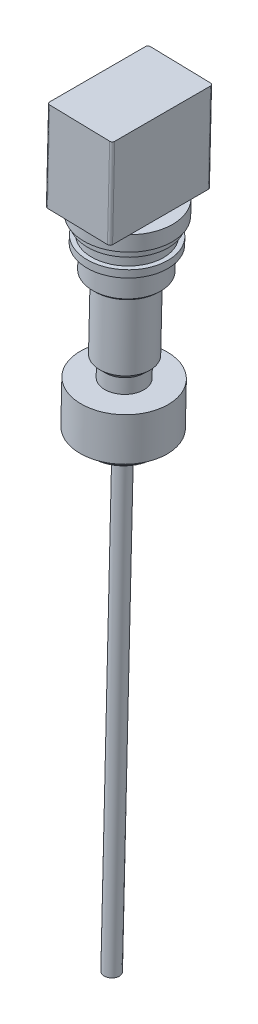
ISO-10303-21;
HEADER;
FILE_DESCRIPTION(('STEP AP214'),'2;1');
FILE_NAME('part.step','',(''),(''),'','','');
FILE_SCHEMA(('AUTOMOTIVE_DESIGN { 1 0 10303 214 1 1 1 1 }'));
ENDSEC;
DATA;
#1=APPLICATION_CONTEXT('core data for automotive mechanical design processes');
#2=APPLICATION_PROTOCOL_DEFINITION('international standard','automotive_design',2000,#1);
#3=PRODUCT_CONTEXT('',#1,'mechanical');
#4=PRODUCT('Part','Part','',(#3));
#5=PRODUCT_RELATED_PRODUCT_CATEGORY('part','',(#4));
#6=PRODUCT_DEFINITION_FORMATION('','',#4);
#7=PRODUCT_DEFINITION_CONTEXT('part definition',#1,'design');
#8=PRODUCT_DEFINITION('design','',#6,#7);
#9=PRODUCT_DEFINITION_SHAPE('','',#8);
#10=(LENGTH_UNIT() NAMED_UNIT(*) SI_UNIT(.MILLI.,.METRE.));
#11=(NAMED_UNIT(*) PLANE_ANGLE_UNIT() SI_UNIT($,.RADIAN.));
#12=(NAMED_UNIT(*) SI_UNIT($,.STERADIAN.) SOLID_ANGLE_UNIT());
#13=UNCERTAINTY_MEASURE_WITH_UNIT(LENGTH_MEASURE(1.E-05),#10,'distance_accuracy_value','');
#14=(GEOMETRIC_REPRESENTATION_CONTEXT(3) GLOBAL_UNCERTAINTY_ASSIGNED_CONTEXT((#13)) GLOBAL_UNIT_ASSIGNED_CONTEXT((#10,
#11,#12)) REPRESENTATION_CONTEXT('',''));
#15=CARTESIAN_POINT('',(0.,0.,0.));
#16=DIRECTION('',(0.,0.,1.));
#17=DIRECTION('',(1.,0.,0.));
#18=AXIS2_PLACEMENT_3D('',#15,#16,#17);
#19=CARTESIAN_POINT('',(12.9138102123787,538.947908708833,0.));
#20=DIRECTION('',(0.0239542717466765,0.999713055263903,0.));
#21=DIRECTION('',(-0.999713055263903,0.0239542717466765,0.));
#22=AXIS2_PLACEMENT_3D('',#19,#20,#21);
#23=PLANE('',#22);
#24=DIRECTION('',(0.,0.,1.));
#25=VECTOR('',#24,1.);
#26=CARTESIAN_POINT('',(327.625903297043,531.407045898229,39.5));
#27=LINE('',#26,#25);
#28=CARTESIAN_POINT('',(327.625903297043,531.407045898229,-23.9739441894736));
#29=VERTEX_POINT('',#28);
#30=CARTESIAN_POINT('',(327.625903297043,531.407045898229,23.9739441894736));
#31=VERTEX_POINT('',#30);
#32=EDGE_CURVE('E157',#29,#31,#27,.T.);
#33=ORIENTED_EDGE('',*,*,#32,.F.);
#34=CARTESIAN_POINT('',(353.118586206273,530.796211968689,0.));
#35=DIRECTION('',(-0.0239542717466765,-0.999713055263903,0.));
#36=DIRECTION('',(0.999713055263903,-0.0239542717466765,0.));
#37=AXIS2_PLACEMENT_3D('',#34,#35,#36);
#38=CIRCLE('',#37,35.);
#39=EDGE_CURVE('E133',#31,#29,#38,.T.);
#40=ORIENTED_EDGE('',*,*,#39,.F.);
#41=EDGE_LOOP('',(#33,#40));
#42=FACE_BOUND('',#41,.T.);
#43=ADVANCED_FACE('F49',(#42),#23,.T.);
#44=CARTESIAN_POINT('',(340.383332009777,-0.699799138684732,0.));
#45=DIRECTION('',(-0.0239542717466765,-0.999713055263903,0.));
#46=DIRECTION('',(0.999713055263903,-0.0239542717466765,0.));
#47=AXIS2_PLACEMENT_3D('',#44,#45,#46);
#48=CYLINDRICAL_SURFACE('',#47,35.);
#49=CARTESIAN_POINT('',(378.611269115502,530.185378039148,23.9739441894738));
#50=VERTEX_POINT('',#49);
#51=EDGE_CURVE('E144',#50,#31,#38,.T.);
#52=ORIENTED_EDGE('',*,*,#51,.T.);
#53=ORIENTED_EDGE('',*,*,#39,.T.);
#54=CARTESIAN_POINT('',(378.611269115502,530.185378039148,-23.9739441894738));
#55=VERTEX_POINT('',#54);
#56=EDGE_CURVE('E126',#29,#55,#38,.T.);
#57=ORIENTED_EDGE('',*,*,#56,.T.);
#58=EDGE_CURVE('E131',#55,#50,#38,.T.);
#59=ORIENTED_EDGE('',*,*,#58,.T.);
#60=EDGE_LOOP('',(#52,#53,#57,#59));
#61=FACE_BOUND('',#60,.T.);
#62=CARTESIAN_POINT('',(352.831134945312,518.799655305522,0.));
#63=DIRECTION('',(-0.0239542717466765,-0.999713055263903,0.));
#64=DIRECTION('',(0.999713055263903,-0.0239542717466765,0.));
#65=AXIS2_PLACEMENT_3D('',#62,#63,#64);
#66=CIRCLE('',#65,35.);
#67=CARTESIAN_POINT('',(387.821091879549,517.961255794388,0.));
#68=VERTEX_POINT('',#67);
#69=EDGE_CURVE('E179',#68,#68,#66,.T.);
#70=ORIENTED_EDGE('',*,*,#69,.F.);
#71=EDGE_LOOP('',(#70));
#72=FACE_BOUND('',#71,.T.);
#73=ADVANCED_FACE('F129',(#61,#72),#48,.T.);
#74=DIRECTION('',(0.,0.,-1.));
#75=VECTOR('',#74,1.);
#76=CARTESIAN_POINT('',(378.611269115502,530.185378039148,39.5));
#77=LINE('',#76,#75);
#78=EDGE_CURVE('E142',#50,#55,#77,.T.);
#79=ORIENTED_EDGE('',*,*,#78,.F.);
#80=ORIENTED_EDGE('',*,*,#58,.F.);
#81=EDGE_LOOP('',(#79,#80));
#82=FACE_BOUND('',#81,.T.);
#83=ADVANCED_FACE('F140',(#82),#23,.T.);
#84=CARTESIAN_POINT('',(0.178556015882637,7.45189760146009,0.));
#85=DIRECTION('',(-0.0239542717466765,-0.999713055263903,0.));
#86=DIRECTION('',(0.999713055263903,-0.0239542717466765,0.));
#87=AXIS2_PLACEMENT_3D('',#84,#85,#86);
#88=PLANE('',#87);
#89=CARTESIAN_POINT('',(340.383332009777,-0.699799138684731,0.));
#90=DIRECTION('',(-0.0239542717466765,-0.999713055263903,0.));
#91=DIRECTION('',(0.999713055263903,-0.0239542717466765,0.));
#92=AXIS2_PLACEMENT_3D('',#89,#90,#91);
#93=CIRCLE('',#92,5.99999999999998);
#94=CARTESIAN_POINT('',(346.381610341361,-0.84352476916479,0.));
#95=VERTEX_POINT('',#94);
#96=EDGE_CURVE('E143',#95,#95,#93,.T.);
#97=ORIENTED_EDGE('',*,*,#96,.T.);
#98=EDGE_LOOP('',(#97));
#99=FACE_BOUND('',#98,.T.);
#100=ADVANCED_FACE('F298',(#99),#88,.T.);
#101=CARTESIAN_POINT('',(340.383332009777,-0.699799138684732,0.));
#102=DIRECTION('',(-0.0239542717466765,-0.999713055263903,0.));
#103=DIRECTION('',(0.999713055263903,-0.0239542717466765,0.));
#104=AXIS2_PLACEMENT_3D('',#101,#102,#103);
#105=CYLINDRICAL_SURFACE('',#104,5.99999999999993);
#106=CARTESIAN_POINT('',(349.118222824578,363.844131739617,0.));
#107=DIRECTION('',(-0.0239542717466765,-0.999713055263903,0.));
#108=DIRECTION('',(0.999713055263903,-0.0239542717466765,0.));
#109=AXIS2_PLACEMENT_3D('',#106,#107,#108);
#110=CIRCLE('',#109,5.99999999999989);
#111=CARTESIAN_POINT('',(355.116501156161,363.700406109137,0.));
#112=VERTEX_POINT('',#111);
#113=EDGE_CURVE('E219',#112,#112,#110,.T.);
#114=ORIENTED_EDGE('',*,*,#113,.T.);
#115=EDGE_LOOP('',(#114));
#116=FACE_BOUND('',#115,.T.);
#117=ORIENTED_EDGE('',*,*,#96,.F.);
#118=EDGE_LOOP('',(#117));
#119=FACE_BOUND('',#118,.T.);
#120=ADVANCED_FACE('F302',(#116,#119),#105,.T.);
#121=CARTESIAN_POINT('',(8.91344683068299,371.995828479762,0.));
#122=DIRECTION('',(-0.0239542717466765,-0.999713055263903,0.));
#123=DIRECTION('',(0.999713055263903,-0.0239542717466765,0.));
#124=AXIS2_PLACEMENT_3D('',#121,#122,#123);
#125=PLANE('',#124);
#126=CARTESIAN_POINT('',(349.118222824578,363.844131739617,0.));
#127=DIRECTION('',(-0.0239542717466765,-0.999713055263903,0.));
#128=DIRECTION('',(0.999713055263903,-0.0239542717466765,0.));
#129=AXIS2_PLACEMENT_3D('',#126,#127,#128);
#130=CIRCLE('',#129,23.7499999999996);
#131=CARTESIAN_POINT('',(372.861407887095,363.275217785633,0.));
#132=VERTEX_POINT('',#131);
#133=EDGE_CURVE('E165',#132,#132,#130,.T.);
#134=ORIENTED_EDGE('',*,*,#133,.T.);
#135=EDGE_LOOP('',(#134));
#136=FACE_BOUND('',#135,.T.);
#137=ORIENTED_EDGE('',*,*,#113,.F.);
#138=EDGE_LOOP('',(#137));
#139=FACE_BOUND('',#138,.T.);
#140=ADVANCED_FACE('F307',(#136,#139),#125,.T.);
#141=CARTESIAN_POINT('',(340.383332009777,-0.699799138684732,0.));
#142=DIRECTION('',(-0.0239542717466765,-0.999713055263903,0.));
#143=DIRECTION('',(0.999713055263903,-0.0239542717466765,0.));
#144=AXIS2_PLACEMENT_3D('',#141,#142,#143);
#145=CYLINDRICAL_SURFACE('',#144,25.7499999999998);
#146=CARTESIAN_POINT('',(349.166131368071,365.843557850145,0.));
#147=DIRECTION('',(-0.0239542717466731,-0.999713055263903,0.));
#148=DIRECTION('',(0.999713055263903,-0.0239542717466731,0.));
#149=AXIS2_PLACEMENT_3D('',#146,#147,#148);
#150=CIRCLE('',#149,25.7499999999998);
#151=CARTESIAN_POINT('',(374.908742541116,365.226735352668,0.));
#152=VERTEX_POINT('',#151);
#153=EDGE_CURVE('E158',#152,#152,#150,.F.);
#154=ORIENTED_EDGE('',*,*,#153,.T.);
#155=EDGE_LOOP('',(#154));
#156=FACE_BOUND('',#155,.T.);
#157=CARTESIAN_POINT('',(349.333811270298,372.841549236992,0.));
#158=DIRECTION('',(-0.0239542717466765,-0.999713055263903,0.));
#159=DIRECTION('',(0.999713055263903,-0.0239542717466765,0.));
#160=AXIS2_PLACEMENT_3D('',#157,#158,#159);
#161=CIRCLE('',#160,25.7499999999998);
#162=CARTESIAN_POINT('',(375.076422443343,372.224726739515,0.));
#163=VERTEX_POINT('',#162);
#164=EDGE_CURVE('E216',#163,#163,#161,.T.);
#165=ORIENTED_EDGE('',*,*,#164,.T.);
#166=EDGE_LOOP('',(#165));
#167=FACE_BOUND('',#166,.T.);
#168=ADVANCED_FACE('F313',(#156,#167),#145,.T.);
#169=CARTESIAN_POINT('',(9.1290352764018,380.993245977137,0.));
#170=DIRECTION('',(-0.0239542717466765,-0.999713055263903,0.));
#171=DIRECTION('',(0.999713055263903,-0.0239542717466765,0.));
#172=AXIS2_PLACEMENT_3D('',#169,#170,#171);
#173=PLANE('',#172);
#174=CARTESIAN_POINT('',(349.333811270298,372.841549236992,0.));
#175=DIRECTION('',(-0.0239542717466765,-0.999713055263903,0.));
#176=DIRECTION('',(0.999713055263903,-0.0239542717466765,0.));
#177=AXIS2_PLACEMENT_3D('',#174,#175,#176);
#178=CIRCLE('',#177,34.5000000000004);
#179=CARTESIAN_POINT('',(383.823911676903,372.015126861732,0.));
#180=VERTEX_POINT('',#179);
#181=EDGE_CURVE('E213',#180,#180,#178,.T.);
#182=ORIENTED_EDGE('',*,*,#181,.T.);
#183=EDGE_LOOP('',(#182));
#184=FACE_BOUND('',#183,.T.);
#185=ORIENTED_EDGE('',*,*,#164,.F.);
#186=EDGE_LOOP('',(#185));
#187=FACE_BOUND('',#186,.T.);
#188=ADVANCED_FACE('F317',(#184,#187),#173,.T.);
#189=CARTESIAN_POINT('',(340.383332009777,-0.699799138684732,0.));
#190=DIRECTION('',(-0.0239542717466765,-0.999713055263903,0.));
#191=DIRECTION('',(0.999713055263903,-0.0239542717466765,0.));
#192=AXIS2_PLACEMENT_3D('',#189,#190,#191);
#193=CYLINDRICAL_SURFACE('',#192,34.5000000000004);
#194=CARTESIAN_POINT('',(350.148256509685,406.831793115965,0.));
#195=DIRECTION('',(-0.0239542717466765,-0.999713055263903,0.));
#196=DIRECTION('',(0.999713055263903,-0.0239542717466765,0.));
#197=AXIS2_PLACEMENT_3D('',#194,#195,#196);
#198=CIRCLE('',#197,34.5000000000004);
#199=CARTESIAN_POINT('',(384.63835691629,406.005370740704,0.));
#200=VERTEX_POINT('',#199);
#201=EDGE_CURVE('E210',#200,#200,#198,.T.);
#202=ORIENTED_EDGE('',*,*,#201,.T.);
#203=EDGE_LOOP('',(#202));
#204=FACE_BOUND('',#203,.T.);
#205=ORIENTED_EDGE('',*,*,#181,.F.);
#206=EDGE_LOOP('',(#205));
#207=FACE_BOUND('',#206,.T.);
#208=ADVANCED_FACE('F321',(#204,#207),#193,.T.);
#209=CARTESIAN_POINT('',(9.94348051578969,414.983489856109,0.));
#210=DIRECTION('',(0.0239542717466765,0.999713055263903,0.));
#211=DIRECTION('',(-0.999713055263903,0.0239542717466765,0.));
#212=AXIS2_PLACEMENT_3D('',#209,#210,#211);
#213=PLANE('',#212);
#214=CARTESIAN_POINT('',(350.148256509685,406.831793115965,0.));
#215=DIRECTION('',(-0.0239542717466765,-0.999713055263903,0.));
#216=DIRECTION('',(0.999713055263903,-0.0239542717466765,0.));
#217=AXIS2_PLACEMENT_3D('',#214,#215,#216);
#218=CIRCLE('',#217,15.5000000000001);
#219=CARTESIAN_POINT('',(365.643808866275,406.460501903891,0.));
#220=VERTEX_POINT('',#219);
#221=EDGE_CURVE('E207',#220,#220,#218,.T.);
#222=ORIENTED_EDGE('',*,*,#221,.T.);
#223=EDGE_LOOP('',(#222));
#224=FACE_BOUND('',#223,.T.);
#225=ORIENTED_EDGE('',*,*,#201,.F.);
#226=EDGE_LOOP('',(#225));
#227=FACE_BOUND('',#226,.T.);
#228=ADVANCED_FACE('F325',(#224,#227),#213,.T.);
#229=CARTESIAN_POINT('',(340.383332009777,-0.699799138684732,0.));
#230=DIRECTION('',(-0.0239542717466765,-0.999713055263903,0.));
#231=DIRECTION('',(0.999713055263903,-0.0239542717466765,0.));
#232=AXIS2_PLACEMENT_3D('',#229,#230,#231);
#233=CYLINDRICAL_SURFACE('',#232,15.5000000000001);
#234=CARTESIAN_POINT('',(350.423730634771,418.328493251502,0.));
#235=DIRECTION('',(0.0239542717466733,0.999713055263903,0.));
#236=DIRECTION('',(-0.999713055263903,0.0239542717466733,0.));
#237=AXIS2_PLACEMENT_3D('',#234,#235,#236);
#238=CIRCLE('',#237,15.5000000000001);
#239=CARTESIAN_POINT('',(334.928178278181,418.699784463575,0.));
#240=VERTEX_POINT('',#239);
#241=EDGE_CURVE('E227',#240,#240,#238,.F.);
#242=ORIENTED_EDGE('',*,*,#241,.T.);
#243=EDGE_LOOP('',(#242));
#244=FACE_BOUND('',#243,.T.);
#245=ORIENTED_EDGE('',*,*,#221,.F.);
#246=EDGE_LOOP('',(#245));
#247=FACE_BOUND('',#246,.T.);
#248=ADVANCED_FACE('F329',(#244,#247),#233,.T.);
#249=CARTESIAN_POINT('',(340.383332009777,-0.699799138684732,0.));
#250=DIRECTION('',(-0.0239542717466765,-0.999713055263903,0.));
#251=DIRECTION('',(0.999713055263903,-0.0239542717466765,0.));
#252=AXIS2_PLACEMENT_3D('',#249,#250,#251);
#253=CYLINDRICAL_SURFACE('',#252,19.9999999999979);
#254=CARTESIAN_POINT('',(350.531524857631,422.827202000187,0.));
#255=DIRECTION('',(-0.0239542717466733,-0.999713055263903,0.));
#256=DIRECTION('',(0.999713055263903,-0.0239542717466733,0.));
#257=AXIS2_PLACEMENT_3D('',#254,#255,#256);
#258=CIRCLE('',#257,19.9999999999979);
#259=CARTESIAN_POINT('',(370.525785962907,422.348116565254,0.));
#260=VERTEX_POINT('',#259);
#261=EDGE_CURVE('E224',#260,#260,#258,.F.);
#262=ORIENTED_EDGE('',*,*,#261,.T.);
#263=EDGE_LOOP('',(#262));
#264=FACE_BOUND('',#263,.T.);
#265=CARTESIAN_POINT('',(351.872964075445,478.811133094966,0.));
#266=DIRECTION('',(-0.0239542717466765,-0.999713055263903,0.));
#267=DIRECTION('',(0.999713055263903,-0.0239542717466765,0.));
#268=AXIS2_PLACEMENT_3D('',#265,#266,#267);
#269=CIRCLE('',#268,19.9999999999979);
#270=CARTESIAN_POINT('',(371.867225180721,478.332047660032,0.));
#271=VERTEX_POINT('',#270);
#272=EDGE_CURVE('E204',#271,#271,#269,.T.);
#273=ORIENTED_EDGE('',*,*,#272,.T.);
#274=EDGE_LOOP('',(#273));
#275=FACE_BOUND('',#274,.T.);
#276=ADVANCED_FACE('F333',(#264,#275),#253,.T.);
#277=CARTESIAN_POINT('',(11.6681880815484,486.962829835111,0.));
#278=DIRECTION('',(-0.0239542717466765,-0.999713055263903,0.));
#279=DIRECTION('',(0.999713055263903,-0.0239542717466765,0.));
#280=AXIS2_PLACEMENT_3D('',#277,#278,#279);
#281=PLANE('',#280);
#282=CARTESIAN_POINT('',(351.872964075445,478.811133094966,0.));
#283=DIRECTION('',(-0.0239542717466765,-0.999713055263903,0.));
#284=DIRECTION('',(0.999713055263903,-0.0239542717466765,0.));
#285=AXIS2_PLACEMENT_3D('',#282,#283,#284);
#286=CIRCLE('',#285,25.);
#287=CARTESIAN_POINT('',(376.865790457043,478.212276301299,0.));
#288=VERTEX_POINT('',#287);
#289=EDGE_CURVE('E230',#288,#288,#286,.T.);
#290=ORIENTED_EDGE('',*,*,#289,.T.);
#291=EDGE_LOOP('',(#290));
#292=FACE_BOUND('',#291,.T.);
#293=ORIENTED_EDGE('',*,*,#272,.F.);
#294=EDGE_LOOP('',(#293));
#295=FACE_BOUND('',#294,.T.);
#296=ADVANCED_FACE('F337',(#292,#295),#281,.T.);
#297=CARTESIAN_POINT('',(340.383332009777,-0.699799138684732,0.));
#298=DIRECTION('',(-0.0239542717466765,-0.999713055263903,0.));
#299=DIRECTION('',(0.999713055263903,-0.0239542717466765,0.));
#300=AXIS2_PLACEMENT_3D('',#297,#298,#299);
#301=CYLINDRICAL_SURFACE('',#300,27.0000000000007);
#302=CARTESIAN_POINT('',(351.920872618939,480.810559205494,0.));
#303=DIRECTION('',(-0.0239542717466691,-0.999713055263903,0.));
#304=DIRECTION('',(0.999713055263903,-0.0239542717466691,0.));
#305=AXIS2_PLACEMENT_3D('',#302,#303,#304);
#306=CIRCLE('',#305,27.0000000000007);
#307=CARTESIAN_POINT('',(378.913125111065,480.163793868334,0.));
#308=VERTEX_POINT('',#307);
#309=EDGE_CURVE('E233',#308,#308,#306,.F.);
#310=ORIENTED_EDGE('',*,*,#309,.T.);
#311=EDGE_LOOP('',(#310));
#312=FACE_BOUND('',#311,.T.);
#313=CARTESIAN_POINT('',(352.352049510379,498.805394200244,0.));
#314=DIRECTION('',(-0.0239542717466765,-0.999713055263903,0.));
#315=DIRECTION('',(0.999713055263903,-0.0239542717466765,0.));
#316=AXIS2_PLACEMENT_3D('',#313,#314,#315);
#317=CIRCLE('',#316,27.0000000000007);
#318=CARTESIAN_POINT('',(379.344302002505,498.158628863083,0.));
#319=VERTEX_POINT('',#318);
#320=EDGE_CURVE('E201',#319,#319,#317,.T.);
#321=ORIENTED_EDGE('',*,*,#320,.T.);
#322=EDGE_LOOP('',(#321));
#323=FACE_BOUND('',#322,.T.);
#324=ADVANCED_FACE('F341',(#312,#323),#301,.T.);
#325=CARTESIAN_POINT('',(12.1472735164842,506.957090940389,0.));
#326=DIRECTION('',(-0.0239542717466765,-0.999713055263903,0.));
#327=DIRECTION('',(0.999713055263903,-0.0239542717466765,0.));
#328=AXIS2_PLACEMENT_3D('',#325,#326,#327);
#329=PLANE('',#328);
#330=CARTESIAN_POINT('',(352.352049510379,498.805394200244,0.));
#331=DIRECTION('',(-0.0239542717466765,-0.999713055263903,0.));
#332=DIRECTION('',(0.999713055263903,-0.0239542717466765,0.));
#333=AXIS2_PLACEMENT_3D('',#330,#331,#332);
#334=CIRCLE('',#333,32.);
#335=CARTESIAN_POINT('',(384.342867278824,498.03885750435,0.));
#336=VERTEX_POINT('',#335);
#337=EDGE_CURVE('E198',#336,#336,#334,.T.);
#338=ORIENTED_EDGE('',*,*,#337,.T.);
#339=EDGE_LOOP('',(#338));
#340=FACE_BOUND('',#339,.T.);
#341=ORIENTED_EDGE('',*,*,#320,.F.);
#342=EDGE_LOOP('',(#341));
#343=FACE_BOUND('',#342,.T.);
#344=ADVANCED_FACE('F345',(#340,#343),#329,.T.);
#345=CARTESIAN_POINT('',(340.383332009777,-0.699799138684732,0.));
#346=DIRECTION('',(-0.0239542717466765,-0.999713055263903,0.));
#347=DIRECTION('',(0.999713055263903,-0.0239542717466765,0.));
#348=AXIS2_PLACEMENT_3D('',#345,#346,#347);
#349=CYLINDRICAL_SURFACE('',#348,32.);
#350=CARTESIAN_POINT('',(352.488588859335,504.503758615248,0.));
#351=DIRECTION('',(-0.0239542717466765,-0.999713055263903,0.));
#352=DIRECTION('',(0.999713055263903,-0.0239542717466765,0.));
#353=AXIS2_PLACEMENT_3D('',#350,#351,#352);
#354=CIRCLE('',#353,32.);
#355=CARTESIAN_POINT('',(384.47940662778,503.737221919354,0.));
#356=VERTEX_POINT('',#355);
#357=EDGE_CURVE('E195',#356,#356,#354,.T.);
#358=ORIENTED_EDGE('',*,*,#357,.T.);
#359=EDGE_LOOP('',(#358));
#360=FACE_BOUND('',#359,.T.);
#361=ORIENTED_EDGE('',*,*,#337,.F.);
#362=EDGE_LOOP('',(#361));
#363=FACE_BOUND('',#362,.T.);
#364=ADVANCED_FACE('F349',(#360,#363),#349,.T.);
#365=CARTESIAN_POINT('',(12.2838128654429,512.655455355393,0.));
#366=DIRECTION('',(0.0239542717466765,0.999713055263903,0.));
#367=DIRECTION('',(-0.999713055263903,0.0239542717466765,0.));
#368=AXIS2_PLACEMENT_3D('',#365,#366,#367);
#369=PLANE('',#368);
#370=CARTESIAN_POINT('',(352.488588859335,504.503758615248,0.));
#371=DIRECTION('',(-0.0239542717466765,-0.999713055263903,0.));
#372=DIRECTION('',(0.999713055263903,-0.0239542717466765,0.));
#373=AXIS2_PLACEMENT_3D('',#370,#371,#372);
#374=CIRCLE('',#373,28.5000000000001);
#375=CARTESIAN_POINT('',(380.980410934356,503.821061870468,0.));
#376=VERTEX_POINT('',#375);
#377=EDGE_CURVE('E192',#376,#376,#374,.T.);
#378=ORIENTED_EDGE('',*,*,#377,.T.);
#379=EDGE_LOOP('',(#378));
#380=FACE_BOUND('',#379,.T.);
#381=ORIENTED_EDGE('',*,*,#357,.F.);
#382=EDGE_LOOP('',(#381));
#383=FACE_BOUND('',#382,.T.);
#384=ADVANCED_FACE('F353',(#380,#383),#369,.T.);
#385=CARTESIAN_POINT('',(340.383332009777,-0.699799138684732,0.));
#386=DIRECTION('',(-0.0239542717466765,-0.999713055263903,0.));
#387=DIRECTION('',(0.999713055263903,-0.0239542717466765,0.));
#388=AXIS2_PLACEMENT_3D('',#385,#386,#387);
#389=CYLINDRICAL_SURFACE('',#388,28.5);
#390=CARTESIAN_POINT('',(352.694595596356,513.101290890518,0.));
#391=DIRECTION('',(-0.0239542717466765,-0.999713055263903,0.));
#392=DIRECTION('',(0.999713055263903,-0.0239542717466765,0.));
#393=AXIS2_PLACEMENT_3D('',#390,#391,#392);
#394=CIRCLE('',#393,28.5);
#395=CARTESIAN_POINT('',(381.186417671378,512.418594145737,0.));
#396=VERTEX_POINT('',#395);
#397=EDGE_CURVE('E189',#396,#396,#394,.T.);
#398=ORIENTED_EDGE('',*,*,#397,.T.);
#399=EDGE_LOOP('',(#398));
#400=FACE_BOUND('',#399,.T.);
#401=ORIENTED_EDGE('',*,*,#377,.F.);
#402=EDGE_LOOP('',(#401));
#403=FACE_BOUND('',#402,.T.);
#404=ADVANCED_FACE('F357',(#400,#403),#389,.T.);
#405=CARTESIAN_POINT('',(12.4898196024273,521.252987630663,0.));
#406=DIRECTION('',(-0.0239542717466765,-0.999713055263903,0.));
#407=DIRECTION('',(0.999713055263903,-0.0239542717466765,0.));
#408=AXIS2_PLACEMENT_3D('',#405,#406,#407);
#409=PLANE('',#408);
#410=CARTESIAN_POINT('',(352.694595596356,513.101290890518,0.));
#411=DIRECTION('',(-0.0239542717466765,-0.999713055263903,0.));
#412=DIRECTION('',(0.999713055263903,-0.0239542717466765,0.));
#413=AXIS2_PLACEMENT_3D('',#410,#411,#412);
#414=CIRCLE('',#413,32.0000000000011);
#415=CARTESIAN_POINT('',(384.685413364802,512.334754194624,0.));
#416=VERTEX_POINT('',#415);
#417=EDGE_CURVE('E186',#416,#416,#414,.T.);
#418=ORIENTED_EDGE('',*,*,#417,.T.);
#419=EDGE_LOOP('',(#418));
#420=FACE_BOUND('',#419,.T.);
#421=ORIENTED_EDGE('',*,*,#397,.F.);
#422=EDGE_LOOP('',(#421));
#423=FACE_BOUND('',#422,.T.);
#424=ADVANCED_FACE('F361',(#420,#423),#409,.T.);
#425=CARTESIAN_POINT('',(340.383332009777,-0.699799138684732,0.));
#426=DIRECTION('',(-0.0239542717466765,-0.999713055263903,0.));
#427=DIRECTION('',(0.999713055263903,-0.0239542717466765,0.));
#428=AXIS2_PLACEMENT_3D('',#425,#426,#427);
#429=CYLINDRICAL_SURFACE('',#428,32.0000000000003);
#430=CARTESIAN_POINT('',(352.831134945312,518.799655305522,0.));
#431=DIRECTION('',(-0.0239542717466765,-0.999713055263903,0.));
#432=DIRECTION('',(0.999713055263903,-0.0239542717466765,0.));
#433=AXIS2_PLACEMENT_3D('',#430,#431,#432);
#434=CIRCLE('',#433,31.9999999999995);
#435=CARTESIAN_POINT('',(384.821952713757,518.033118609628,0.));
#436=VERTEX_POINT('',#435);
#437=EDGE_CURVE('E182',#436,#436,#434,.T.);
#438=ORIENTED_EDGE('',*,*,#437,.T.);
#439=EDGE_LOOP('',(#438));
#440=FACE_BOUND('',#439,.T.);
#441=ORIENTED_EDGE('',*,*,#417,.F.);
#442=EDGE_LOOP('',(#441));
#443=FACE_BOUND('',#442,.T.);
#444=ADVANCED_FACE('F365',(#440,#443),#429,.T.);
#445=CARTESIAN_POINT('',(12.6263589514237,526.951352045666,0.));
#446=DIRECTION('',(-0.0239542717466765,-0.999713055263903,0.));
#447=DIRECTION('',(0.999713055263903,-0.0239542717466765,0.));
#448=AXIS2_PLACEMENT_3D('',#445,#446,#447);
#449=PLANE('',#448);
#450=ORIENTED_EDGE('',*,*,#69,.T.);
#451=EDGE_LOOP('',(#450));
#452=FACE_BOUND('',#451,.T.);
#453=ORIENTED_EDGE('',*,*,#437,.F.);
#454=EDGE_LOOP('',(#453));
#455=FACE_BOUND('',#454,.T.);
#456=ADVANCED_FACE('F369',(#452,#455),#449,.T.);
#457=CARTESIAN_POINT('',(350.411753498898,417.828636723868,0.));
#458=DIRECTION('',(0.0239542717466733,0.999713055263903,0.));
#459=DIRECTION('',(-0.999713055263903,0.0239542717466733,0.));
#460=AXIS2_PLACEMENT_3D('',#457,#458,#459);
#461=CONICAL_SURFACE('',#460,14.9999999999978,0.785398163397462);
#462=ORIENTED_EDGE('',*,*,#261,.F.);
#463=EDGE_LOOP('',(#462));
#464=FACE_BOUND('',#463,.T.);
#465=ORIENTED_EDGE('',*,*,#241,.F.);
#466=EDGE_LOOP('',(#465));
#467=FACE_BOUND('',#466,.T.);
#468=ADVANCED_FACE('F373',(#464,#467),#461,.T.);
#469=CARTESIAN_POINT('',(351.872964075445,478.811133094966,0.));
#470=DIRECTION('',(0.0239542717466691,0.999713055263903,0.));
#471=DIRECTION('',(-0.999713055263903,0.0239542717466691,0.));
#472=AXIS2_PLACEMENT_3D('',#469,#470,#471);
#473=CONICAL_SURFACE('',#472,25.0000000000002,0.785398163397476);
#474=ORIENTED_EDGE('',*,*,#309,.F.);
#475=EDGE_LOOP('',(#474));
#476=FACE_BOUND('',#475,.T.);
#477=ORIENTED_EDGE('',*,*,#289,.F.);
#478=EDGE_LOOP('',(#477));
#479=FACE_BOUND('',#478,.T.);
#480=ADVANCED_FACE('F473',(#476,#479),#473,.T.);
#481=CARTESIAN_POINT('',(349.118222824578,363.844131739617,0.));
#482=DIRECTION('',(0.0239542717466731,0.999713055263903,0.));
#483=DIRECTION('',(-0.999713055263903,0.0239542717466731,0.));
#484=AXIS2_PLACEMENT_3D('',#481,#482,#483);
#485=CONICAL_SURFACE('',#484,23.7499999999998,0.785398163397455);
#486=ORIENTED_EDGE('',*,*,#153,.F.);
#487=EDGE_LOOP('',(#486));
#488=FACE_BOUND('',#487,.T.);
#489=ORIENTED_EDGE('',*,*,#133,.F.);
#490=EDGE_LOOP('',(#489));
#491=FACE_BOUND('',#490,.T.);
#492=ADVANCED_FACE('F461',(#488,#491),#485,.T.);
#493=CARTESIAN_POINT('',(12.9138102123779,538.947908708834,0.));
#494=DIRECTION('',(0.0239542717466767,0.999713055263902,0.));
#495=DIRECTION('',(-0.999713055263902,0.0239542717466767,0.));
#496=AXIS2_PLACEMENT_3D('',#493,#494,#495);
#497=PLANE('',#496);
#498=DIRECTION('',(0.999713055263902,-0.0239542717466767,0.));
#499=VECTOR('',#498,1.);
#500=CARTESIAN_POINT('',(378.611269115502,530.185378039148,39.5));
#501=LINE('',#500,#499);
#502=CARTESIAN_POINT('',(329.625329407571,531.359137354736,39.5));
#503=VERTEX_POINT('',#502);
#504=CARTESIAN_POINT('',(376.611843004974,530.233286582642,39.5));
#505=VERTEX_POINT('',#504);
#506=EDGE_CURVE('E153',#503,#505,#501,.T.);
#507=ORIENTED_EDGE('',*,*,#506,.F.);
#508=CARTESIAN_POINT('',(329.625329407571,531.359137354736,37.5));
#509=DIRECTION('',(0.0239542717466767,0.999713055263902,0.));
#510=DIRECTION('',(-0.999713055263902,0.0239542717466767,0.));
#511=AXIS2_PLACEMENT_3D('',#508,#509,#510);
#512=CIRCLE('',#511,2.);
#513=CARTESIAN_POINT('',(327.625903297043,531.407045898229,37.5));
#514=VERTEX_POINT('',#513);
#515=EDGE_CURVE('E13',#503,#514,#512,.F.);
#516=ORIENTED_EDGE('',*,*,#515,.T.);
#517=EDGE_CURVE('E163',#31,#514,#27,.T.);
#518=ORIENTED_EDGE('',*,*,#517,.F.);
#519=ORIENTED_EDGE('',*,*,#51,.F.);
#520=CARTESIAN_POINT('',(378.611269115502,530.185378039148,37.5));
#521=VERTEX_POINT('',#520);
#522=EDGE_CURVE('E152',#521,#50,#77,.T.);
#523=ORIENTED_EDGE('',*,*,#522,.F.);
#524=CARTESIAN_POINT('',(376.611843004974,530.233286582642,37.5));
#525=DIRECTION('',(0.0239542717466767,0.999713055263902,0.));
#526=DIRECTION('',(-0.999713055263902,0.0239542717466767,0.));
#527=AXIS2_PLACEMENT_3D('',#524,#525,#526);
#528=CIRCLE('',#527,2.);
#529=EDGE_CURVE('E57',#521,#505,#528,.F.);
#530=ORIENTED_EDGE('',*,*,#529,.T.);
#531=EDGE_LOOP('',(#507,#516,#518,#519,#523,#530));
#532=FACE_BOUND('',#531,.T.);
#533=ADVANCED_FACE('F270',(#532),#497,.F.);
#534=CARTESIAN_POINT('',(329.326656591057,602.386672821966,39.5));
#535=DIRECTION('',(0.999713055263902,-0.0239542717466767,0.));
#536=DIRECTION('',(0.0239542717466767,0.999713055263902,0.));
#537=AXIS2_PLACEMENT_3D('',#534,#535,#536);
#538=PLANE('',#537);
#539=DIRECTION('',(0.,0.,1.));
#540=VECTOR('',#539,1.);
#541=CARTESIAN_POINT('',(329.326656591057,602.386672821966,39.5));
#542=LINE('',#541,#540);
#543=CARTESIAN_POINT('',(329.326656591057,602.386672821966,-37.5));
#544=VERTEX_POINT('',#543);
#545=CARTESIAN_POINT('',(329.326656591057,602.386672821966,37.5));
#546=VERTEX_POINT('',#545);
#547=EDGE_CURVE('E171',#544,#546,#542,.T.);
#548=ORIENTED_EDGE('',*,*,#547,.F.);
#549=DIRECTION('',(-0.0239542717466767,-0.999713055263902,0.));
#550=VECTOR('',#549,1.);
#551=CARTESIAN_POINT('',(329.326656591057,602.386672821966,-37.5));
#552=LINE('',#551,#550);
#553=CARTESIAN_POINT('',(327.625903297043,531.407045898229,-37.5));
#554=VERTEX_POINT('',#553);
#555=EDGE_CURVE('E239',#544,#554,#552,.T.);
#556=ORIENTED_EDGE('',*,*,#555,.T.);
#557=EDGE_CURVE('E162',#554,#29,#27,.T.);
#558=ORIENTED_EDGE('',*,*,#557,.T.);
#559=ORIENTED_EDGE('',*,*,#32,.T.);
#560=ORIENTED_EDGE('',*,*,#517,.T.);
#561=DIRECTION('',(-0.0239542717466767,-0.999713055263902,0.));
#562=VECTOR('',#561,1.);
#563=CARTESIAN_POINT('',(329.326656591057,602.386672821966,37.5));
#564=LINE('',#563,#562);
#565=EDGE_CURVE('E160',#514,#546,#564,.F.);
#566=ORIENTED_EDGE('',*,*,#565,.T.);
#567=EDGE_LOOP('',(#548,#556,#558,#559,#560,#566));
#568=FACE_BOUND('',#567,.T.);
#569=ADVANCED_FACE('F288',(#568),#538,.F.);
#570=CARTESIAN_POINT('',(380.312022409516,601.165004962886,39.5));
#571=DIRECTION('',(0.,0.,-1.));
#572=DIRECTION('',(-1.,0.,0.));
#573=AXIS2_PLACEMENT_3D('',#570,#571,#572);
#574=PLANE('',#573);
#575=DIRECTION('',(0.999713055263902,-0.0239542717466767,0.));
#576=VECTOR('',#575,1.);
#577=CARTESIAN_POINT('',(380.312022409516,601.165004962886,39.5));
#578=LINE('',#577,#576);
#579=CARTESIAN_POINT('',(331.326082701585,602.338764278473,39.5));
#580=VERTEX_POINT('',#579);
#581=CARTESIAN_POINT('',(378.312596298988,601.212913506379,39.5));
#582=VERTEX_POINT('',#581);
#583=EDGE_CURVE('E176',#580,#582,#578,.T.);
#584=ORIENTED_EDGE('',*,*,#583,.F.);
#585=DIRECTION('',(-0.0239542717466767,-0.999713055263902,0.));
#586=VECTOR('',#585,1.);
#587=CARTESIAN_POINT('',(331.326082701585,602.338764278473,39.5));
#588=LINE('',#587,#586);
#589=EDGE_CURVE('E263',#580,#503,#588,.T.);
#590=ORIENTED_EDGE('',*,*,#589,.T.);
#591=ORIENTED_EDGE('',*,*,#506,.T.);
#592=DIRECTION('',(-0.0239542717466767,-0.999713055263902,0.));
#593=VECTOR('',#592,1.);
#594=CARTESIAN_POINT('',(378.312596298988,601.212913506379,39.5));
#595=LINE('',#594,#593);
#596=EDGE_CURVE('E261',#505,#582,#595,.F.);
#597=ORIENTED_EDGE('',*,*,#596,.T.);
#598=EDGE_LOOP('',(#584,#590,#591,#597));
#599=FACE_BOUND('',#598,.T.);
#600=ADVANCED_FACE('F266',(#599),#574,.F.);
#601=CARTESIAN_POINT('',(380.312022409516,601.165004962886,39.5));
#602=DIRECTION('',(-0.999713055263902,0.0239542717466767,0.));
#603=DIRECTION('',(-0.0239542717466767,-0.999713055263902,0.));
#604=AXIS2_PLACEMENT_3D('',#601,#602,#603);
#605=PLANE('',#604);
#606=CARTESIAN_POINT('',(378.611269115502,530.185378039148,-37.5));
#607=VERTEX_POINT('',#606);
#608=EDGE_CURVE('E146',#55,#607,#77,.T.);
#609=ORIENTED_EDGE('',*,*,#608,.T.);
#610=DIRECTION('',(-0.0239542717466767,-0.999713055263902,0.));
#611=VECTOR('',#610,1.);
#612=CARTESIAN_POINT('',(380.312022409516,601.165004962886,-37.5));
#613=LINE('',#612,#611);
#614=CARTESIAN_POINT('',(380.312022409516,601.165004962886,-37.5));
#615=VERTEX_POINT('',#614);
#616=EDGE_CURVE('E259',#607,#615,#613,.F.);
#617=ORIENTED_EDGE('',*,*,#616,.T.);
#618=DIRECTION('',(0.,0.,-1.));
#619=VECTOR('',#618,1.);
#620=CARTESIAN_POINT('',(380.312022409516,601.165004962886,39.5));
#621=LINE('',#620,#619);
#622=CARTESIAN_POINT('',(380.312022409516,601.165004962886,37.5));
#623=VERTEX_POINT('',#622);
#624=EDGE_CURVE('E276',#623,#615,#621,.T.);
#625=ORIENTED_EDGE('',*,*,#624,.F.);
#626=DIRECTION('',(-0.0239542717466767,-0.999713055263902,0.));
#627=VECTOR('',#626,1.);
#628=CARTESIAN_POINT('',(380.312022409516,601.165004962886,37.5));
#629=LINE('',#628,#627);
#630=EDGE_CURVE('E257',#623,#521,#629,.T.);
#631=ORIENTED_EDGE('',*,*,#630,.T.);
#632=ORIENTED_EDGE('',*,*,#522,.T.);
#633=ORIENTED_EDGE('',*,*,#78,.T.);
#634=EDGE_LOOP('',(#609,#617,#625,#631,#632,#633));
#635=FACE_BOUND('',#634,.T.);
#636=ADVANCED_FACE('F155',(#635),#605,.F.);
#637=CARTESIAN_POINT('',(380.312022409516,601.165004962886,-39.5));
#638=DIRECTION('',(0.,0.,1.));
#639=DIRECTION('',(1.,0.,0.));
#640=AXIS2_PLACEMENT_3D('',#637,#638,#639);
#641=PLANE('',#640);
#642=DIRECTION('',(-0.999713055263902,0.0239542717466767,0.));
#643=VECTOR('',#642,1.);
#644=CARTESIAN_POINT('',(378.611269115502,530.185378039148,-39.5));
#645=LINE('',#644,#643);
#646=CARTESIAN_POINT('',(376.611843004974,530.233286582642,-39.5));
#647=VERTEX_POINT('',#646);
#648=CARTESIAN_POINT('',(329.625329407571,531.359137354736,-39.5));
#649=VERTEX_POINT('',#648);
#650=EDGE_CURVE('E169',#647,#649,#645,.T.);
#651=ORIENTED_EDGE('',*,*,#650,.T.);
#652=DIRECTION('',(-0.0239542717466767,-0.999713055263902,0.));
#653=VECTOR('',#652,1.);
#654=CARTESIAN_POINT('',(331.326082701585,602.338764278473,-39.5));
#655=LINE('',#654,#653);
#656=CARTESIAN_POINT('',(331.326082701585,602.338764278473,-39.5));
#657=VERTEX_POINT('',#656);
#658=EDGE_CURVE('E247',#649,#657,#655,.F.);
#659=ORIENTED_EDGE('',*,*,#658,.T.);
#660=DIRECTION('',(-0.999713055263902,0.0239542717466767,0.));
#661=VECTOR('',#660,1.);
#662=CARTESIAN_POINT('',(380.312022409516,601.165004962886,-39.5));
#663=LINE('',#662,#661);
#664=CARTESIAN_POINT('',(378.312596298988,601.212913506379,-39.5));
#665=VERTEX_POINT('',#664);
#666=EDGE_CURVE('E183',#665,#657,#663,.T.);
#667=ORIENTED_EDGE('',*,*,#666,.F.);
#668=DIRECTION('',(-0.0239542717466767,-0.999713055263902,0.));
#669=VECTOR('',#668,1.);
#670=CARTESIAN_POINT('',(378.312596298988,601.212913506379,-39.5));
#671=LINE('',#670,#669);
#672=EDGE_CURVE('E245',#665,#647,#671,.T.);
#673=ORIENTED_EDGE('',*,*,#672,.T.);
#674=EDGE_LOOP('',(#651,#659,#667,#673));
#675=FACE_BOUND('',#674,.T.);
#676=ADVANCED_FACE('F381',(#675),#641,.F.);
#677=CARTESIAN_POINT('',(14.6145635063919,609.927535632571,0.));
#678=DIRECTION('',(0.0239542717466767,0.999713055263902,0.));
#679=DIRECTION('',(-0.999713055263902,0.0239542717466767,0.));
#680=AXIS2_PLACEMENT_3D('',#677,#678,#679);
#681=PLANE('',#680);
#682=ORIENTED_EDGE('',*,*,#666,.T.);
#683=CARTESIAN_POINT('',(331.326082701585,602.338764278473,-37.5));
#684=DIRECTION('',(0.0239542717466767,0.999713055263902,0.));
#685=DIRECTION('',(-0.999713055263902,0.0239542717466767,0.));
#686=AXIS2_PLACEMENT_3D('',#683,#684,#685);
#687=CIRCLE('',#686,2.);
#688=EDGE_CURVE('E255',#657,#544,#687,.T.);
#689=ORIENTED_EDGE('',*,*,#688,.T.);
#690=ORIENTED_EDGE('',*,*,#547,.T.);
#691=CARTESIAN_POINT('',(331.326082701585,602.338764278473,37.5));
#692=DIRECTION('',(0.0239542717466767,0.999713055263902,0.));
#693=DIRECTION('',(-0.999713055263902,0.0239542717466767,0.));
#694=AXIS2_PLACEMENT_3D('',#691,#692,#693);
#695=CIRCLE('',#694,2.);
#696=EDGE_CURVE('E251',#546,#580,#695,.T.);
#697=ORIENTED_EDGE('',*,*,#696,.T.);
#698=ORIENTED_EDGE('',*,*,#583,.T.);
#699=CARTESIAN_POINT('',(378.312596298988,601.212913506379,37.5));
#700=DIRECTION('',(0.0239542717466767,0.999713055263902,0.));
#701=DIRECTION('',(-0.999713055263902,0.0239542717466767,0.));
#702=AXIS2_PLACEMENT_3D('',#699,#700,#701);
#703=CIRCLE('',#702,2.);
#704=EDGE_CURVE('E249',#582,#623,#703,.T.);
#705=ORIENTED_EDGE('',*,*,#704,.T.);
#706=ORIENTED_EDGE('',*,*,#624,.T.);
#707=CARTESIAN_POINT('',(378.312596298988,601.212913506379,-37.5));
#708=DIRECTION('',(0.0239542717466767,0.999713055263902,0.));
#709=DIRECTION('',(-0.999713055263902,0.0239542717466767,0.));
#710=AXIS2_PLACEMENT_3D('',#707,#708,#709);
#711=CIRCLE('',#710,2.);
#712=EDGE_CURVE('E253',#615,#665,#711,.T.);
#713=ORIENTED_EDGE('',*,*,#712,.T.);
#714=EDGE_LOOP('',(#682,#689,#690,#697,#698,#705,#706,#713));
#715=FACE_BOUND('',#714,.T.);
#716=ADVANCED_FACE('F281',(#715),#681,.T.);
#717=ORIENTED_EDGE('',*,*,#557,.F.);
#718=CARTESIAN_POINT('',(329.625329407571,531.359137354736,-37.5));
#719=DIRECTION('',(0.0239542717466767,0.999713055263902,0.));
#720=DIRECTION('',(-0.999713055263902,0.0239542717466767,0.));
#721=AXIS2_PLACEMENT_3D('',#718,#719,#720);
#722=CIRCLE('',#721,2.);
#723=EDGE_CURVE('E243',#554,#649,#722,.F.);
#724=ORIENTED_EDGE('',*,*,#723,.T.);
#725=ORIENTED_EDGE('',*,*,#650,.F.);
#726=CARTESIAN_POINT('',(376.611843004974,530.233286582642,-37.5));
#727=DIRECTION('',(0.0239542717466767,0.999713055263902,0.));
#728=DIRECTION('',(-0.999713055263902,0.0239542717466767,0.));
#729=AXIS2_PLACEMENT_3D('',#726,#727,#728);
#730=CIRCLE('',#729,2.);
#731=EDGE_CURVE('E149',#647,#607,#730,.F.);
#732=ORIENTED_EDGE('',*,*,#731,.T.);
#733=ORIENTED_EDGE('',*,*,#608,.F.);
#734=ORIENTED_EDGE('',*,*,#56,.F.);
#735=EDGE_LOOP('',(#717,#724,#725,#732,#733,#734));
#736=FACE_BOUND('',#735,.T.);
#737=ADVANCED_FACE('F147',(#736),#497,.F.);
#738=CARTESIAN_POINT('',(331.326082701585,602.338764278473,-37.5));
#739=DIRECTION('',(-0.0239542717466767,-0.999713055263902,0.));
#740=DIRECTION('',(0.999713055263902,-0.0239542717466767,0.));
#741=AXIS2_PLACEMENT_3D('',#738,#739,#740);
#742=CYLINDRICAL_SURFACE('',#741,2.);
#743=ORIENTED_EDGE('',*,*,#688,.F.);
#744=ORIENTED_EDGE('',*,*,#658,.F.);
#745=ORIENTED_EDGE('',*,*,#723,.F.);
#746=ORIENTED_EDGE('',*,*,#555,.F.);
#747=EDGE_LOOP('',(#743,#744,#745,#746));
#748=FACE_BOUND('',#747,.T.);
#749=ADVANCED_FACE('F386',(#748),#742,.T.);
#750=CARTESIAN_POINT('',(378.312596298988,601.212913506379,-37.5));
#751=DIRECTION('',(-0.0239542717466767,-0.999713055263902,0.));
#752=DIRECTION('',(0.999713055263902,-0.0239542717466767,0.));
#753=AXIS2_PLACEMENT_3D('',#750,#751,#752);
#754=CYLINDRICAL_SURFACE('',#753,2.);
#755=ORIENTED_EDGE('',*,*,#712,.F.);
#756=ORIENTED_EDGE('',*,*,#616,.F.);
#757=ORIENTED_EDGE('',*,*,#731,.F.);
#758=ORIENTED_EDGE('',*,*,#672,.F.);
#759=EDGE_LOOP('',(#755,#756,#757,#758));
#760=FACE_BOUND('',#759,.T.);
#761=ADVANCED_FACE('F402',(#760),#754,.T.);
#762=CARTESIAN_POINT('',(331.326082701585,602.338764278473,37.5));
#763=DIRECTION('',(-0.0239542717466767,-0.999713055263902,0.));
#764=DIRECTION('',(0.999713055263902,-0.0239542717466767,0.));
#765=AXIS2_PLACEMENT_3D('',#762,#763,#764);
#766=CYLINDRICAL_SURFACE('',#765,2.);
#767=ORIENTED_EDGE('',*,*,#696,.F.);
#768=ORIENTED_EDGE('',*,*,#565,.F.);
#769=ORIENTED_EDGE('',*,*,#515,.F.);
#770=ORIENTED_EDGE('',*,*,#589,.F.);
#771=EDGE_LOOP('',(#767,#768,#769,#770));
#772=FACE_BOUND('',#771,.T.);
#773=ADVANCED_FACE('F410',(#772),#766,.T.);
#774=CARTESIAN_POINT('',(378.312596298988,601.212913506379,37.5));
#775=DIRECTION('',(-0.0239542717466767,-0.999713055263902,0.));
#776=DIRECTION('',(0.999713055263902,-0.0239542717466767,0.));
#777=AXIS2_PLACEMENT_3D('',#774,#775,#776);
#778=CYLINDRICAL_SURFACE('',#777,2.);
#779=ORIENTED_EDGE('',*,*,#704,.F.);
#780=ORIENTED_EDGE('',*,*,#596,.F.);
#781=ORIENTED_EDGE('',*,*,#529,.F.);
#782=ORIENTED_EDGE('',*,*,#630,.F.);
#783=EDGE_LOOP('',(#779,#780,#781,#782));
#784=FACE_BOUND('',#783,.T.);
#785=ADVANCED_FACE('F51',(#784),#778,.T.);
#786=CLOSED_SHELL('',(#43,#73,#83,#100,#120,#140,#168,#188,#208,#228,#248,#276,#296,#324,#344,
#364,#384,#404,#424,#444,#456,#468,#480,#492,#533,#569,#600,#636,#676,#716,#737,#749,#761,#773,#785));
#787=MANIFOLD_SOLID_BREP('B2',#786);
#788=ADVANCED_BREP_SHAPE_REPRESENTATION('',(#18,#787),#14);
#789=SHAPE_DEFINITION_REPRESENTATION(#9,#788);
ENDSEC;
END-ISO-10303-21;
